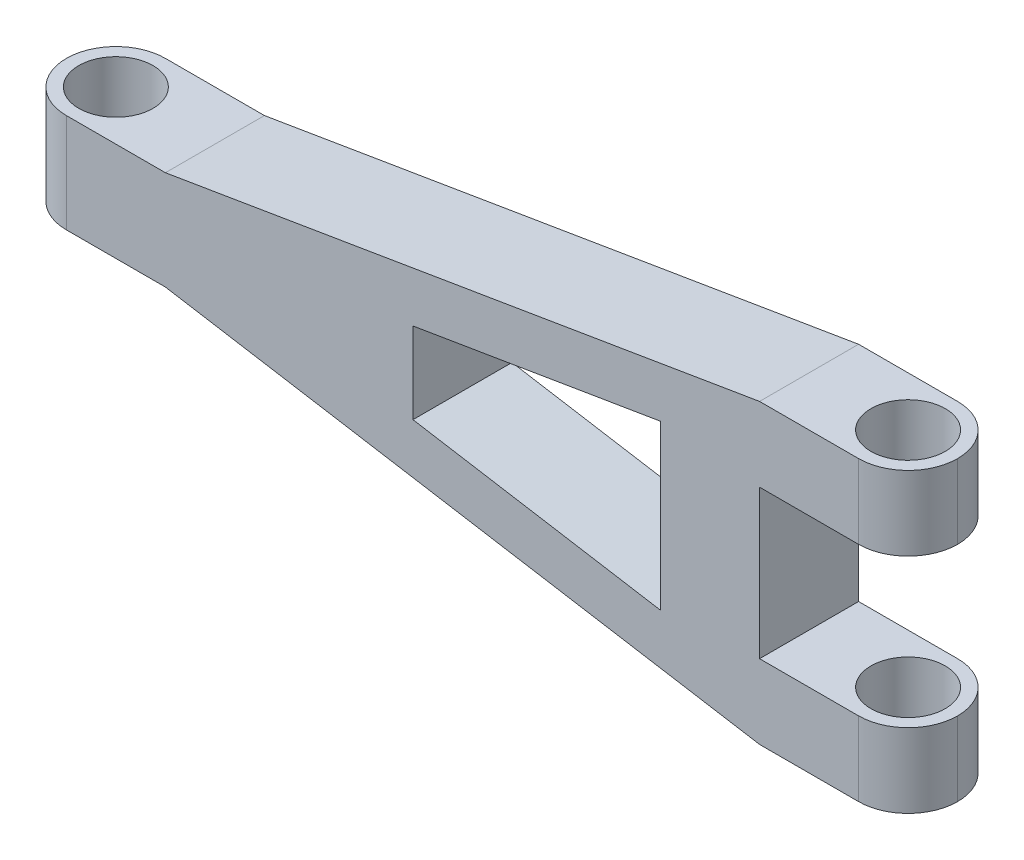
ISO-10303-21;
HEADER;
FILE_DESCRIPTION(('STEP AP214'),'2;1');
FILE_NAME('part.step','',(''),(''),'','','');
FILE_SCHEMA(('AUTOMOTIVE_DESIGN { 1 0 10303 214 1 1 1 1 }'));
ENDSEC;
DATA;
#1=APPLICATION_CONTEXT('core data for automotive mechanical design processes');
#2=APPLICATION_PROTOCOL_DEFINITION('international standard','automotive_design',2000,#1);
#3=PRODUCT_CONTEXT('',#1,'mechanical');
#4=PRODUCT('Part','Part','',(#3));
#5=PRODUCT_RELATED_PRODUCT_CATEGORY('part','',(#4));
#6=PRODUCT_DEFINITION_FORMATION('','',#4);
#7=PRODUCT_DEFINITION_CONTEXT('part definition',#1,'design');
#8=PRODUCT_DEFINITION('design','',#6,#7);
#9=PRODUCT_DEFINITION_SHAPE('','',#8);
#10=(LENGTH_UNIT() NAMED_UNIT(*) SI_UNIT(.MILLI.,.METRE.));
#11=(NAMED_UNIT(*) PLANE_ANGLE_UNIT() SI_UNIT($,.RADIAN.));
#12=(NAMED_UNIT(*) SI_UNIT($,.STERADIAN.) SOLID_ANGLE_UNIT());
#13=UNCERTAINTY_MEASURE_WITH_UNIT(LENGTH_MEASURE(1.E-05),#10,'distance_accuracy_value','');
#14=(GEOMETRIC_REPRESENTATION_CONTEXT(3) GLOBAL_UNCERTAINTY_ASSIGNED_CONTEXT((#13)) GLOBAL_UNIT_ASSIGNED_CONTEXT((#10,
#11,#12)) REPRESENTATION_CONTEXT('',''));
#15=CARTESIAN_POINT('',(0.,0.,0.));
#16=DIRECTION('',(0.,0.,1.));
#17=DIRECTION('',(1.,0.,0.));
#18=AXIS2_PLACEMENT_3D('',#15,#16,#17);
#19=CARTESIAN_POINT('',(-50.,-5.00000000000001,20.));
#20=DIRECTION('',(0.,-1.,0.));
#21=DIRECTION('',(1.,0.,0.));
#22=AXIS2_PLACEMENT_3D('',#19,#20,#21);
#23=PLANE('',#22);
#24=CARTESIAN_POINT('',(-70.,-5.,10.));
#25=DIRECTION('',(0.,-1.,0.));
#26=DIRECTION('',(1.,0.,0.));
#27=AXIS2_PLACEMENT_3D('',#24,#25,#26);
#28=CIRCLE('',#27,7.5);
#29=CARTESIAN_POINT('',(-70.,-5.,17.5));
#30=VERTEX_POINT('',#29);
#31=EDGE_CURVE('E339',#30,#30,#28,.T.);
#32=ORIENTED_EDGE('',*,*,#31,.F.);
#33=EDGE_LOOP('',(#32));
#34=FACE_BOUND('',#33,.T.);
#35=CARTESIAN_POINT('',(-70.,-5.,10.));
#36=DIRECTION('',(0.,-1.,0.));
#37=DIRECTION('',(1.,0.,0.));
#38=AXIS2_PLACEMENT_3D('',#35,#36,#37);
#39=CIRCLE('',#38,10.);
#40=CARTESIAN_POINT('',(-70.,-5.,20.));
#41=VERTEX_POINT('',#40);
#42=CARTESIAN_POINT('',(-80.,-5.,10.));
#43=VERTEX_POINT('',#42);
#44=EDGE_CURVE('E65',#41,#43,#39,.T.);
#45=ORIENTED_EDGE('',*,*,#44,.T.);
#46=CARTESIAN_POINT('',(-70.,-5.,10.));
#47=DIRECTION('',(0.,-1.,0.));
#48=DIRECTION('',(1.,0.,0.));
#49=AXIS2_PLACEMENT_3D('',#46,#47,#48);
#50=CIRCLE('',#49,10.);
#51=CARTESIAN_POINT('',(-70.,-5.,0.));
#52=VERTEX_POINT('',#51);
#53=EDGE_CURVE('E314',#43,#52,#50,.T.);
#54=ORIENTED_EDGE('',*,*,#53,.T.);
#55=DIRECTION('',(-1.,0.,0.));
#56=VECTOR('',#55,1.);
#57=CARTESIAN_POINT('',(-50.,-5.00000000000001,0.));
#58=LINE('',#57,#56);
#59=CARTESIAN_POINT('',(-50.,-5.00000000000001,0.));
#60=VERTEX_POINT('',#59);
#61=EDGE_CURVE('E217',#60,#52,#58,.T.);
#62=ORIENTED_EDGE('',*,*,#61,.F.);
#63=DIRECTION('',(0.,0.,-1.));
#64=VECTOR('',#63,1.);
#65=CARTESIAN_POINT('',(-50.,-5.00000000000001,20.));
#66=LINE('',#65,#64);
#67=CARTESIAN_POINT('',(-50.,-5.00000000000001,20.));
#68=VERTEX_POINT('',#67);
#69=EDGE_CURVE('E280',#68,#60,#66,.T.);
#70=ORIENTED_EDGE('',*,*,#69,.F.);
#71=DIRECTION('',(-1.,0.,0.));
#72=VECTOR('',#71,1.);
#73=CARTESIAN_POINT('',(-50.,-5.00000000000001,20.));
#74=LINE('',#73,#72);
#75=EDGE_CURVE('E221',#68,#41,#74,.T.);
#76=ORIENTED_EDGE('',*,*,#75,.T.);
#77=EDGE_LOOP('',(#45,#54,#62,#70,#76));
#78=FACE_BOUND('',#77,.T.);
#79=ADVANCED_FACE('F42',(#34,#78),#23,.T.);
#80=CARTESIAN_POINT('',(70.,-25.,20.));
#81=DIRECTION('',(-0.164398987305357,-0.986393923832144,0.));
#82=DIRECTION('',(0.986393923832144,-0.164398987305357,0.));
#83=AXIS2_PLACEMENT_3D('',#80,#81,#82);
#84=PLANE('',#83);
#85=DIRECTION('',(-0.986393923832144,0.164398987305357,0.));
#86=VECTOR('',#85,1.);
#87=CARTESIAN_POINT('',(70.,-25.,0.));
#88=LINE('',#87,#86);
#89=CARTESIAN_POINT('',(70.,-25.,0.));
#90=VERTEX_POINT('',#89);
#91=EDGE_CURVE('E248',#90,#60,#88,.T.);
#92=ORIENTED_EDGE('',*,*,#91,.F.);
#93=DIRECTION('',(0.,0.,-1.));
#94=VECTOR('',#93,1.);
#95=CARTESIAN_POINT('',(70.,-25.,20.));
#96=LINE('',#95,#94);
#97=CARTESIAN_POINT('',(70.,-25.,20.));
#98=VERTEX_POINT('',#97);
#99=EDGE_CURVE('E278',#98,#90,#96,.T.);
#100=ORIENTED_EDGE('',*,*,#99,.F.);
#101=DIRECTION('',(-0.986393923832144,0.164398987305357,0.));
#102=VECTOR('',#101,1.);
#103=CARTESIAN_POINT('',(70.,-25.,20.));
#104=LINE('',#103,#102);
#105=EDGE_CURVE('E223',#98,#68,#104,.T.);
#106=ORIENTED_EDGE('',*,*,#105,.T.);
#107=ORIENTED_EDGE('',*,*,#69,.T.);
#108=EDGE_LOOP('',(#92,#100,#106,#107));
#109=FACE_BOUND('',#108,.T.);
#110=ADVANCED_FACE('F365',(#109),#84,.T.);
#111=CARTESIAN_POINT('',(70.,-25.,20.));
#112=DIRECTION('',(0.,1.,0.));
#113=DIRECTION('',(0.,0.,1.));
#114=AXIS2_PLACEMENT_3D('',#111,#112,#113);
#115=PLANE('',#114);
#116=CARTESIAN_POINT('',(90.0000000000001,-25.,10.));
#117=DIRECTION('',(0.,1.,0.));
#118=DIRECTION('',(0.,0.,1.));
#119=AXIS2_PLACEMENT_3D('',#116,#117,#118);
#120=CIRCLE('',#119,7.5);
#121=CARTESIAN_POINT('',(90.0000000000001,-25.,17.5));
#122=VERTEX_POINT('',#121);
#123=EDGE_CURVE('E330',#122,#122,#120,.T.);
#124=ORIENTED_EDGE('',*,*,#123,.T.);
#125=EDGE_LOOP('',(#124));
#126=FACE_BOUND('',#125,.T.);
#127=CARTESIAN_POINT('',(90.,-25.,10.));
#128=DIRECTION('',(0.,1.,0.));
#129=DIRECTION('',(0.,0.,1.));
#130=AXIS2_PLACEMENT_3D('',#127,#128,#129);
#131=CIRCLE('',#130,10.);
#132=CARTESIAN_POINT('',(90.,-25.,0.));
#133=VERTEX_POINT('',#132);
#134=CARTESIAN_POINT('',(100.,-25.,10.));
#135=VERTEX_POINT('',#134);
#136=EDGE_CURVE('E282',#133,#135,#131,.F.);
#137=ORIENTED_EDGE('',*,*,#136,.T.);
#138=CARTESIAN_POINT('',(90.,-25.,10.));
#139=DIRECTION('',(0.,1.,0.));
#140=DIRECTION('',(0.,0.,1.));
#141=AXIS2_PLACEMENT_3D('',#138,#139,#140);
#142=CIRCLE('',#141,10.);
#143=CARTESIAN_POINT('',(90.,-25.,20.));
#144=VERTEX_POINT('',#143);
#145=EDGE_CURVE('E284',#135,#144,#142,.F.);
#146=ORIENTED_EDGE('',*,*,#145,.T.);
#147=DIRECTION('',(1.,0.,0.));
#148=VECTOR('',#147,1.);
#149=CARTESIAN_POINT('',(70.,-25.,20.));
#150=LINE('',#149,#148);
#151=EDGE_CURVE('E227',#98,#144,#150,.T.);
#152=ORIENTED_EDGE('',*,*,#151,.F.);
#153=ORIENTED_EDGE('',*,*,#99,.T.);
#154=DIRECTION('',(1.,0.,0.));
#155=VECTOR('',#154,1.);
#156=CARTESIAN_POINT('',(70.,-25.,0.));
#157=LINE('',#156,#155);
#158=EDGE_CURVE('E251',#90,#133,#157,.T.);
#159=ORIENTED_EDGE('',*,*,#158,.T.);
#160=EDGE_LOOP('',(#137,#146,#152,#153,#159));
#161=FACE_BOUND('',#160,.T.);
#162=ADVANCED_FACE('F406',(#126,#161),#115,.F.);
#163=CARTESIAN_POINT('',(100.,-10.,20.));
#164=DIRECTION('',(0.,-1.,0.));
#165=DIRECTION('',(0.,0.,-1.));
#166=AXIS2_PLACEMENT_3D('',#163,#164,#165);
#167=PLANE('',#166);
#168=CARTESIAN_POINT('',(90.0000000000001,-10.,10.));
#169=DIRECTION('',(0.,-1.,0.));
#170=DIRECTION('',(0.,0.,-1.));
#171=AXIS2_PLACEMENT_3D('',#168,#169,#170);
#172=CIRCLE('',#171,7.5);
#173=CARTESIAN_POINT('',(90.0000000000001,-10.,17.5));
#174=VERTEX_POINT('',#173);
#175=EDGE_CURVE('E204',#174,#174,#172,.T.);
#176=ORIENTED_EDGE('',*,*,#175,.T.);
#177=EDGE_LOOP('',(#176));
#178=FACE_BOUND('',#177,.T.);
#179=DIRECTION('',(-1.,0.,0.));
#180=VECTOR('',#179,1.);
#181=CARTESIAN_POINT('',(100.,-10.,20.));
#182=LINE('',#181,#180);
#183=CARTESIAN_POINT('',(90.,-10.,20.));
#184=VERTEX_POINT('',#183);
#185=CARTESIAN_POINT('',(70.,-10.,20.));
#186=VERTEX_POINT('',#185);
#187=EDGE_CURVE('E230',#184,#186,#182,.T.);
#188=ORIENTED_EDGE('',*,*,#187,.F.);
#189=CARTESIAN_POINT('',(90.,-10.,10.));
#190=DIRECTION('',(0.,-1.,0.));
#191=DIRECTION('',(0.,0.,-1.));
#192=AXIS2_PLACEMENT_3D('',#189,#190,#191);
#193=CIRCLE('',#192,10.);
#194=CARTESIAN_POINT('',(100.,-10.,10.));
#195=VERTEX_POINT('',#194);
#196=EDGE_CURVE('E295',#184,#195,#193,.F.);
#197=ORIENTED_EDGE('',*,*,#196,.T.);
#198=CARTESIAN_POINT('',(90.,-10.,10.));
#199=DIRECTION('',(0.,-1.,0.));
#200=DIRECTION('',(0.,0.,-1.));
#201=AXIS2_PLACEMENT_3D('',#198,#199,#200);
#202=CIRCLE('',#201,10.);
#203=CARTESIAN_POINT('',(90.,-10.,0.));
#204=VERTEX_POINT('',#203);
#205=EDGE_CURVE('E293',#195,#204,#202,.F.);
#206=ORIENTED_EDGE('',*,*,#205,.T.);
#207=DIRECTION('',(-1.,0.,0.));
#208=VECTOR('',#207,1.);
#209=CARTESIAN_POINT('',(100.,-10.,0.));
#210=LINE('',#209,#208);
#211=CARTESIAN_POINT('',(70.,-10.,0.));
#212=VERTEX_POINT('',#211);
#213=EDGE_CURVE('E254',#204,#212,#210,.T.);
#214=ORIENTED_EDGE('',*,*,#213,.T.);
#215=DIRECTION('',(0.,0.,-1.));
#216=VECTOR('',#215,1.);
#217=CARTESIAN_POINT('',(70.,-10.,20.));
#218=LINE('',#217,#216);
#219=EDGE_CURVE('E275',#186,#212,#218,.T.);
#220=ORIENTED_EDGE('',*,*,#219,.F.);
#221=EDGE_LOOP('',(#188,#197,#206,#214,#220));
#222=FACE_BOUND('',#221,.T.);
#223=ADVANCED_FACE('F410',(#178,#222),#167,.F.);
#224=CARTESIAN_POINT('',(70.,20.,20.));
#225=DIRECTION('',(1.,0.,0.));
#226=DIRECTION('',(0.,0.,-1.));
#227=AXIS2_PLACEMENT_3D('',#224,#225,#226);
#228=PLANE('',#227);
#229=DIRECTION('',(0.,-1.,0.));
#230=VECTOR('',#229,1.);
#231=CARTESIAN_POINT('',(70.,20.,0.));
#232=LINE('',#231,#230);
#233=CARTESIAN_POINT('',(70.,20.,0.));
#234=VERTEX_POINT('',#233);
#235=EDGE_CURVE('E256',#234,#212,#232,.T.);
#236=ORIENTED_EDGE('',*,*,#235,.F.);
#237=DIRECTION('',(0.,0.,-1.));
#238=VECTOR('',#237,1.);
#239=CARTESIAN_POINT('',(70.,20.,20.));
#240=LINE('',#239,#238);
#241=CARTESIAN_POINT('',(70.,20.,20.));
#242=VERTEX_POINT('',#241);
#243=EDGE_CURVE('E272',#242,#234,#240,.T.);
#244=ORIENTED_EDGE('',*,*,#243,.F.);
#245=DIRECTION('',(0.,-1.,0.));
#246=VECTOR('',#245,1.);
#247=CARTESIAN_POINT('',(70.,20.,20.));
#248=LINE('',#247,#246);
#249=EDGE_CURVE('E232',#242,#186,#248,.T.);
#250=ORIENTED_EDGE('',*,*,#249,.T.);
#251=ORIENTED_EDGE('',*,*,#219,.T.);
#252=EDGE_LOOP('',(#236,#244,#250,#251));
#253=FACE_BOUND('',#252,.T.);
#254=ADVANCED_FACE('F395',(#253),#228,.T.);
#255=CARTESIAN_POINT('',(100.,20.,20.));
#256=DIRECTION('',(0.,-1.,0.));
#257=DIRECTION('',(1.,0.,0.));
#258=AXIS2_PLACEMENT_3D('',#255,#256,#257);
#259=PLANE('',#258);
#260=CARTESIAN_POINT('',(90.0000000000001,20.,10.));
#261=DIRECTION('',(0.,-1.,0.));
#262=DIRECTION('',(1.,0.,0.));
#263=AXIS2_PLACEMENT_3D('',#260,#261,#262);
#264=CIRCLE('',#263,7.5);
#265=CARTESIAN_POINT('',(90.0000000000001,20.,17.5));
#266=VERTEX_POINT('',#265);
#267=EDGE_CURVE('E326',#266,#266,#264,.T.);
#268=ORIENTED_EDGE('',*,*,#267,.F.);
#269=EDGE_LOOP('',(#268));
#270=FACE_BOUND('',#269,.T.);
#271=DIRECTION('',(-1.,0.,0.));
#272=VECTOR('',#271,1.);
#273=CARTESIAN_POINT('',(100.,20.,0.));
#274=LINE('',#273,#272);
#275=CARTESIAN_POINT('',(90.0000000000001,20.,0.));
#276=VERTEX_POINT('',#275);
#277=EDGE_CURVE('E259',#276,#234,#274,.T.);
#278=ORIENTED_EDGE('',*,*,#277,.F.);
#279=CARTESIAN_POINT('',(90.0000000000001,20.,10.));
#280=DIRECTION('',(0.,-1.,0.));
#281=DIRECTION('',(1.,0.,0.));
#282=AXIS2_PLACEMENT_3D('',#279,#280,#281);
#283=CIRCLE('',#282,10.);
#284=CARTESIAN_POINT('',(100.,20.,10.));
#285=VERTEX_POINT('',#284);
#286=EDGE_CURVE('E311',#276,#285,#283,.T.);
#287=ORIENTED_EDGE('',*,*,#286,.T.);
#288=CARTESIAN_POINT('',(90.0000000000001,20.,10.));
#289=DIRECTION('',(0.,-1.,0.));
#290=DIRECTION('',(1.,0.,0.));
#291=AXIS2_PLACEMENT_3D('',#288,#289,#290);
#292=CIRCLE('',#291,10.);
#293=CARTESIAN_POINT('',(90.0000000000001,20.,20.));
#294=VERTEX_POINT('',#293);
#295=EDGE_CURVE('E309',#285,#294,#292,.T.);
#296=ORIENTED_EDGE('',*,*,#295,.T.);
#297=DIRECTION('',(-1.,0.,0.));
#298=VECTOR('',#297,1.);
#299=CARTESIAN_POINT('',(100.,20.,20.));
#300=LINE('',#299,#298);
#301=EDGE_CURVE('E235',#294,#242,#300,.T.);
#302=ORIENTED_EDGE('',*,*,#301,.T.);
#303=ORIENTED_EDGE('',*,*,#243,.T.);
#304=EDGE_LOOP('',(#278,#287,#296,#302,#303));
#305=FACE_BOUND('',#304,.T.);
#306=ADVANCED_FACE('F386',(#270,#305),#259,.T.);
#307=CARTESIAN_POINT('',(70.,35.,20.));
#308=DIRECTION('',(0.,1.,0.));
#309=DIRECTION('',(-1.,0.,0.));
#310=AXIS2_PLACEMENT_3D('',#307,#308,#309);
#311=PLANE('',#310);
#312=CARTESIAN_POINT('',(90.0000000000001,35.,10.));
#313=DIRECTION('',(0.,1.,0.));
#314=DIRECTION('',(0.,0.,1.));
#315=AXIS2_PLACEMENT_3D('',#312,#313,#314);
#316=CIRCLE('',#315,7.5);
#317=CARTESIAN_POINT('',(90.0000000000001,35.,17.5));
#318=VERTEX_POINT('',#317);
#319=EDGE_CURVE('E334',#318,#318,#316,.T.);
#320=ORIENTED_EDGE('',*,*,#319,.F.);
#321=EDGE_LOOP('',(#320));
#322=FACE_BOUND('',#321,.T.);
#323=CARTESIAN_POINT('',(90.0000000000001,35.,10.));
#324=DIRECTION('',(0.,1.,0.));
#325=DIRECTION('',(-1.,0.,0.));
#326=AXIS2_PLACEMENT_3D('',#323,#324,#325);
#327=CIRCLE('',#326,10.);
#328=CARTESIAN_POINT('',(90.0000000000001,35.,20.));
#329=VERTEX_POINT('',#328);
#330=CARTESIAN_POINT('',(100.,35.,10.));
#331=VERTEX_POINT('',#330);
#332=EDGE_CURVE('E305',#329,#331,#327,.T.);
#333=ORIENTED_EDGE('',*,*,#332,.T.);
#334=CARTESIAN_POINT('',(90.0000000000001,35.,10.));
#335=DIRECTION('',(0.,1.,0.));
#336=DIRECTION('',(-1.,0.,0.));
#337=AXIS2_PLACEMENT_3D('',#334,#335,#336);
#338=CIRCLE('',#337,10.);
#339=CARTESIAN_POINT('',(90.0000000000001,35.,0.));
#340=VERTEX_POINT('',#339);
#341=EDGE_CURVE('E307',#331,#340,#338,.T.);
#342=ORIENTED_EDGE('',*,*,#341,.T.);
#343=DIRECTION('',(1.,0.,0.));
#344=VECTOR('',#343,1.);
#345=CARTESIAN_POINT('',(70.,35.,0.));
#346=LINE('',#345,#344);
#347=CARTESIAN_POINT('',(70.,35.,0.));
#348=VERTEX_POINT('',#347);
#349=EDGE_CURVE('E261',#348,#340,#346,.T.);
#350=ORIENTED_EDGE('',*,*,#349,.F.);
#351=DIRECTION('',(0.,0.,-1.));
#352=VECTOR('',#351,1.);
#353=CARTESIAN_POINT('',(70.,35.,20.));
#354=LINE('',#353,#352);
#355=CARTESIAN_POINT('',(70.,35.,20.));
#356=VERTEX_POINT('',#355);
#357=EDGE_CURVE('E270',#356,#348,#354,.T.);
#358=ORIENTED_EDGE('',*,*,#357,.F.);
#359=DIRECTION('',(1.,0.,0.));
#360=VECTOR('',#359,1.);
#361=CARTESIAN_POINT('',(70.,35.,20.));
#362=LINE('',#361,#360);
#363=EDGE_CURVE('E237',#356,#329,#362,.T.);
#364=ORIENTED_EDGE('',*,*,#363,.T.);
#365=EDGE_LOOP('',(#333,#342,#350,#358,#364));
#366=FACE_BOUND('',#365,.T.);
#367=ADVANCED_FACE('F376',(#322,#366),#311,.T.);
#368=CARTESIAN_POINT('',(70.,35.,20.));
#369=DIRECTION('',(0.164398987305357,-0.986393923832144,0.));
#370=DIRECTION('',(0.986393923832144,0.164398987305357,0.));
#371=AXIS2_PLACEMENT_3D('',#368,#369,#370);
#372=PLANE('',#371);
#373=DIRECTION('',(-0.986393923832144,-0.164398987305357,0.));
#374=VECTOR('',#373,1.);
#375=CARTESIAN_POINT('',(70.,35.,0.));
#376=LINE('',#375,#374);
#377=CARTESIAN_POINT('',(-50.,15.,0.));
#378=VERTEX_POINT('',#377);
#379=EDGE_CURVE('E264',#348,#378,#376,.T.);
#380=ORIENTED_EDGE('',*,*,#379,.T.);
#381=DIRECTION('',(0.,0.,-1.));
#382=VECTOR('',#381,1.);
#383=CARTESIAN_POINT('',(-50.,15.,20.));
#384=LINE('',#383,#382);
#385=CARTESIAN_POINT('',(-50.,15.,20.));
#386=VERTEX_POINT('',#385);
#387=EDGE_CURVE('E245',#386,#378,#384,.T.);
#388=ORIENTED_EDGE('',*,*,#387,.F.);
#389=DIRECTION('',(-0.986393923832144,-0.164398987305357,0.));
#390=VECTOR('',#389,1.);
#391=CARTESIAN_POINT('',(70.,35.,20.));
#392=LINE('',#391,#390);
#393=EDGE_CURVE('E240',#356,#386,#392,.T.);
#394=ORIENTED_EDGE('',*,*,#393,.F.);
#395=ORIENTED_EDGE('',*,*,#357,.T.);
#396=EDGE_LOOP('',(#380,#388,#394,#395));
#397=FACE_BOUND('',#396,.T.);
#398=ADVANCED_FACE('F350',(#397),#372,.F.);
#399=CARTESIAN_POINT('',(-80.,15.,20.));
#400=DIRECTION('',(0.,1.,0.));
#401=DIRECTION('',(-1.,0.,0.));
#402=AXIS2_PLACEMENT_3D('',#399,#400,#401);
#403=PLANE('',#402);
#404=CARTESIAN_POINT('',(-70.,15.,10.));
#405=DIRECTION('',(0.,1.,0.));
#406=DIRECTION('',(-1.,0.,0.));
#407=AXIS2_PLACEMENT_3D('',#404,#405,#406);
#408=CIRCLE('',#407,7.5);
#409=CARTESIAN_POINT('',(-70.,15.,17.5));
#410=VERTEX_POINT('',#409);
#411=EDGE_CURVE('E46',#410,#410,#408,.T.);
#412=ORIENTED_EDGE('',*,*,#411,.F.);
#413=EDGE_LOOP('',(#412));
#414=FACE_BOUND('',#413,.T.);
#415=DIRECTION('',(1.,0.,0.));
#416=VECTOR('',#415,1.);
#417=CARTESIAN_POINT('',(-80.,15.,0.));
#418=LINE('',#417,#416);
#419=CARTESIAN_POINT('',(-70.,15.,0.));
#420=VERTEX_POINT('',#419);
#421=EDGE_CURVE('E224',#420,#378,#418,.T.);
#422=ORIENTED_EDGE('',*,*,#421,.F.);
#423=CARTESIAN_POINT('',(-70.,15.,10.));
#424=DIRECTION('',(0.,1.,0.));
#425=DIRECTION('',(-1.,0.,0.));
#426=AXIS2_PLACEMENT_3D('',#423,#424,#425);
#427=CIRCLE('',#426,10.);
#428=CARTESIAN_POINT('',(-80.,15.,10.));
#429=VERTEX_POINT('',#428);
#430=EDGE_CURVE('E11',#420,#429,#427,.T.);
#431=ORIENTED_EDGE('',*,*,#430,.T.);
#432=CARTESIAN_POINT('',(-70.,15.,10.));
#433=DIRECTION('',(0.,1.,0.));
#434=DIRECTION('',(-1.,0.,0.));
#435=AXIS2_PLACEMENT_3D('',#432,#433,#434);
#436=CIRCLE('',#435,10.);
#437=CARTESIAN_POINT('',(-70.,15.,20.));
#438=VERTEX_POINT('',#437);
#439=EDGE_CURVE('E51',#429,#438,#436,.T.);
#440=ORIENTED_EDGE('',*,*,#439,.T.);
#441=DIRECTION('',(1.,0.,0.));
#442=VECTOR('',#441,1.);
#443=CARTESIAN_POINT('',(-80.,15.,20.));
#444=LINE('',#443,#442);
#445=EDGE_CURVE('E243',#438,#386,#444,.T.);
#446=ORIENTED_EDGE('',*,*,#445,.T.);
#447=ORIENTED_EDGE('',*,*,#387,.T.);
#448=EDGE_LOOP('',(#422,#431,#440,#446,#447));
#449=FACE_BOUND('',#448,.T.);
#450=ADVANCED_FACE('F348',(#414,#449),#403,.T.);
#451=CARTESIAN_POINT('',(-80.,-25.,20.));
#452=DIRECTION('',(0.,0.,1.));
#453=DIRECTION('',(1.,0.,0.));
#454=AXIS2_PLACEMENT_3D('',#451,#452,#453);
#455=PLANE('',#454);
#456=DIRECTION('',(0.,-1.,0.));
#457=VECTOR('',#456,1.);
#458=CARTESIAN_POINT('',(50.,21.5287291161696,20.));
#459=LINE('',#458,#457);
#460=CARTESIAN_POINT('',(50.,21.5287291161696,20.));
#461=VERTEX_POINT('',#460);
#462=CARTESIAN_POINT('',(50.,-11.5287291161696,20.));
#463=VERTEX_POINT('',#462);
#464=EDGE_CURVE('E186',#461,#463,#459,.T.);
#465=ORIENTED_EDGE('',*,*,#464,.T.);
#466=DIRECTION('',(0.986393923832144,-0.164398987305357,0.));
#467=VECTOR('',#466,1.);
#468=CARTESIAN_POINT('',(0.,-3.1953957828363,20.));
#469=LINE('',#468,#467);
#470=CARTESIAN_POINT('',(0.,-3.1953957828363,20.));
#471=VERTEX_POINT('',#470);
#472=EDGE_CURVE('E174',#471,#463,#469,.T.);
#473=ORIENTED_EDGE('',*,*,#472,.F.);
#474=DIRECTION('',(0.,-1.,0.));
#475=VECTOR('',#474,1.);
#476=CARTESIAN_POINT('',(0.,13.1953957828363,20.));
#477=LINE('',#476,#475);
#478=CARTESIAN_POINT('',(0.,13.1953957828363,20.));
#479=VERTEX_POINT('',#478);
#480=EDGE_CURVE('E185',#479,#471,#477,.T.);
#481=ORIENTED_EDGE('',*,*,#480,.F.);
#482=DIRECTION('',(-0.986393923832144,-0.164398987305357,0.));
#483=VECTOR('',#482,1.);
#484=CARTESIAN_POINT('',(50.,21.5287291161696,20.));
#485=LINE('',#484,#483);
#486=EDGE_CURVE('E194',#461,#479,#485,.T.);
#487=ORIENTED_EDGE('',*,*,#486,.F.);
#488=EDGE_LOOP('',(#465,#473,#481,#487));
#489=FACE_BOUND('',#488,.T.);
#490=ORIENTED_EDGE('',*,*,#151,.T.);
#491=DIRECTION('',(0.,-1.,0.));
#492=VECTOR('',#491,1.);
#493=CARTESIAN_POINT('',(90.,-25.,20.));
#494=LINE('',#493,#492);
#495=EDGE_CURVE('E290',#144,#184,#494,.F.);
#496=ORIENTED_EDGE('',*,*,#495,.T.);
#497=ORIENTED_EDGE('',*,*,#187,.T.);
#498=ORIENTED_EDGE('',*,*,#249,.F.);
#499=ORIENTED_EDGE('',*,*,#301,.F.);
#500=DIRECTION('',(0.,1.,0.));
#501=VECTOR('',#500,1.);
#502=CARTESIAN_POINT('',(90.0000000000001,35.,20.));
#503=LINE('',#502,#501);
#504=EDGE_CURVE('E288',#294,#329,#503,.T.);
#505=ORIENTED_EDGE('',*,*,#504,.T.);
#506=ORIENTED_EDGE('',*,*,#363,.F.);
#507=ORIENTED_EDGE('',*,*,#393,.T.);
#508=ORIENTED_EDGE('',*,*,#445,.F.);
#509=DIRECTION('',(0.,-1.,0.));
#510=VECTOR('',#509,1.);
#511=CARTESIAN_POINT('',(-70.,-5.,20.));
#512=LINE('',#511,#510);
#513=EDGE_CURVE('E286',#438,#41,#512,.T.);
#514=ORIENTED_EDGE('',*,*,#513,.T.);
#515=ORIENTED_EDGE('',*,*,#75,.F.);
#516=ORIENTED_EDGE('',*,*,#105,.F.);
#517=EDGE_LOOP('',(#490,#496,#497,#498,#499,#505,#506,#507,#508,#514,#515,#516));
#518=FACE_BOUND('',#517,.T.);
#519=ADVANCED_FACE('F196',(#489,#518),#455,.T.);
#520=CARTESIAN_POINT('',(-80.,-25.,0.));
#521=DIRECTION('',(0.,0.,1.));
#522=DIRECTION('',(1.,0.,0.));
#523=AXIS2_PLACEMENT_3D('',#520,#521,#522);
#524=PLANE('',#523);
#525=DIRECTION('',(0.986393923832144,-0.164398987305357,0.));
#526=VECTOR('',#525,1.);
#527=CARTESIAN_POINT('',(0.,-3.1953957828363,0.));
#528=LINE('',#527,#526);
#529=CARTESIAN_POINT('',(0.,-3.1953957828363,0.));
#530=VERTEX_POINT('',#529);
#531=CARTESIAN_POINT('',(50.,-11.5287291161696,0.));
#532=VERTEX_POINT('',#531);
#533=EDGE_CURVE('E210',#530,#532,#528,.T.);
#534=ORIENTED_EDGE('',*,*,#533,.T.);
#535=DIRECTION('',(0.,-1.,0.));
#536=VECTOR('',#535,1.);
#537=CARTESIAN_POINT('',(50.,21.5287291161696,0.));
#538=LINE('',#537,#536);
#539=CARTESIAN_POINT('',(50.,21.5287291161696,0.));
#540=VERTEX_POINT('',#539);
#541=EDGE_CURVE('E193',#540,#532,#538,.T.);
#542=ORIENTED_EDGE('',*,*,#541,.F.);
#543=DIRECTION('',(-0.986393923832144,-0.164398987305357,0.));
#544=VECTOR('',#543,1.);
#545=CARTESIAN_POINT('',(50.,21.5287291161696,0.));
#546=LINE('',#545,#544);
#547=CARTESIAN_POINT('',(0.,13.1953957828363,0.));
#548=VERTEX_POINT('',#547);
#549=EDGE_CURVE('E198',#540,#548,#546,.T.);
#550=ORIENTED_EDGE('',*,*,#549,.T.);
#551=DIRECTION('',(0.,-1.,0.));
#552=VECTOR('',#551,1.);
#553=CARTESIAN_POINT('',(0.,13.1953957828363,0.));
#554=LINE('',#553,#552);
#555=EDGE_CURVE('E201',#548,#530,#554,.T.);
#556=ORIENTED_EDGE('',*,*,#555,.T.);
#557=EDGE_LOOP('',(#534,#542,#550,#556));
#558=FACE_BOUND('',#557,.T.);
#559=ORIENTED_EDGE('',*,*,#213,.F.);
#560=DIRECTION('',(0.,-1.,0.));
#561=VECTOR('',#560,1.);
#562=CARTESIAN_POINT('',(90.,-25.,0.));
#563=LINE('',#562,#561);
#564=EDGE_CURVE('E303',#204,#133,#563,.T.);
#565=ORIENTED_EDGE('',*,*,#564,.T.);
#566=ORIENTED_EDGE('',*,*,#158,.F.);
#567=ORIENTED_EDGE('',*,*,#91,.T.);
#568=ORIENTED_EDGE('',*,*,#61,.T.);
#569=DIRECTION('',(0.,-1.,0.));
#570=VECTOR('',#569,1.);
#571=CARTESIAN_POINT('',(-70.,-25.,0.));
#572=LINE('',#571,#570);
#573=EDGE_CURVE('E297',#52,#420,#572,.F.);
#574=ORIENTED_EDGE('',*,*,#573,.T.);
#575=ORIENTED_EDGE('',*,*,#421,.T.);
#576=ORIENTED_EDGE('',*,*,#379,.F.);
#577=ORIENTED_EDGE('',*,*,#349,.T.);
#578=DIRECTION('',(0.,1.,0.));
#579=VECTOR('',#578,1.);
#580=CARTESIAN_POINT('',(90.0000000000001,-25.,0.));
#581=LINE('',#580,#579);
#582=EDGE_CURVE('E300',#340,#276,#581,.F.);
#583=ORIENTED_EDGE('',*,*,#582,.T.);
#584=ORIENTED_EDGE('',*,*,#277,.T.);
#585=ORIENTED_EDGE('',*,*,#235,.T.);
#586=EDGE_LOOP('',(#559,#565,#566,#567,#568,#574,#575,#576,#577,#583,#584,#585));
#587=FACE_BOUND('',#586,.T.);
#588=ADVANCED_FACE('F356',(#558,#587),#524,.F.);
#589=CARTESIAN_POINT('',(50.,21.5287291161696,20.));
#590=DIRECTION('',(1.,0.,0.));
#591=DIRECTION('',(0.,0.,-1.));
#592=AXIS2_PLACEMENT_3D('',#589,#590,#591);
#593=PLANE('',#592);
#594=ORIENTED_EDGE('',*,*,#541,.T.);
#595=DIRECTION('',(0.,0.,-1.));
#596=VECTOR('',#595,1.);
#597=CARTESIAN_POINT('',(50.,-11.5287291161696,20.));
#598=LINE('',#597,#596);
#599=EDGE_CURVE('E178',#463,#532,#598,.T.);
#600=ORIENTED_EDGE('',*,*,#599,.F.);
#601=ORIENTED_EDGE('',*,*,#464,.F.);
#602=DIRECTION('',(0.,0.,-1.));
#603=VECTOR('',#602,1.);
#604=CARTESIAN_POINT('',(50.,21.5287291161696,20.));
#605=LINE('',#604,#603);
#606=EDGE_CURVE('E215',#461,#540,#605,.T.);
#607=ORIENTED_EDGE('',*,*,#606,.T.);
#608=EDGE_LOOP('',(#594,#600,#601,#607));
#609=FACE_BOUND('',#608,.T.);
#610=ADVANCED_FACE('F190',(#609),#593,.F.);
#611=CARTESIAN_POINT('',(50.,21.5287291161696,20.));
#612=DIRECTION('',(0.164398987305357,-0.986393923832144,0.));
#613=DIRECTION('',(0.986393923832144,0.164398987305357,0.));
#614=AXIS2_PLACEMENT_3D('',#611,#612,#613);
#615=PLANE('',#614);
#616=ORIENTED_EDGE('',*,*,#549,.F.);
#617=ORIENTED_EDGE('',*,*,#606,.F.);
#618=ORIENTED_EDGE('',*,*,#486,.T.);
#619=DIRECTION('',(0.,0.,-1.));
#620=VECTOR('',#619,1.);
#621=CARTESIAN_POINT('',(0.,13.1953957828363,20.));
#622=LINE('',#621,#620);
#623=EDGE_CURVE('E218',#479,#548,#622,.T.);
#624=ORIENTED_EDGE('',*,*,#623,.T.);
#625=EDGE_LOOP('',(#616,#617,#618,#624));
#626=FACE_BOUND('',#625,.T.);
#627=ADVANCED_FACE('F474',(#626),#615,.T.);
#628=CARTESIAN_POINT('',(0.,13.1953957828363,20.));
#629=DIRECTION('',(1.,0.,0.));
#630=DIRECTION('',(0.,1.,0.));
#631=AXIS2_PLACEMENT_3D('',#628,#629,#630);
#632=PLANE('',#631);
#633=ORIENTED_EDGE('',*,*,#555,.F.);
#634=ORIENTED_EDGE('',*,*,#623,.F.);
#635=ORIENTED_EDGE('',*,*,#480,.T.);
#636=DIRECTION('',(0.,0.,-1.));
#637=VECTOR('',#636,1.);
#638=CARTESIAN_POINT('',(0.,-3.1953957828363,20.));
#639=LINE('',#638,#637);
#640=EDGE_CURVE('E180',#471,#530,#639,.T.);
#641=ORIENTED_EDGE('',*,*,#640,.T.);
#642=EDGE_LOOP('',(#633,#634,#635,#641));
#643=FACE_BOUND('',#642,.T.);
#644=ADVANCED_FACE('F467',(#643),#632,.T.);
#645=CARTESIAN_POINT('',(0.,-3.1953957828363,20.));
#646=DIRECTION('',(0.164398987305357,0.986393923832144,0.));
#647=DIRECTION('',(-0.986393923832144,0.164398987305357,0.));
#648=AXIS2_PLACEMENT_3D('',#645,#646,#647);
#649=PLANE('',#648);
#650=ORIENTED_EDGE('',*,*,#533,.F.);
#651=ORIENTED_EDGE('',*,*,#640,.F.);
#652=ORIENTED_EDGE('',*,*,#472,.T.);
#653=ORIENTED_EDGE('',*,*,#599,.T.);
#654=EDGE_LOOP('',(#650,#651,#652,#653));
#655=FACE_BOUND('',#654,.T.);
#656=ADVANCED_FACE('F177',(#655),#649,.T.);
#657=CARTESIAN_POINT('',(90.,-25.,10.));
#658=DIRECTION('',(0.,1.,0.));
#659=DIRECTION('',(0.,0.,1.));
#660=AXIS2_PLACEMENT_3D('',#657,#658,#659);
#661=CYLINDRICAL_SURFACE('',#660,10.);
#662=ORIENTED_EDGE('',*,*,#564,.F.);
#663=ORIENTED_EDGE('',*,*,#205,.F.);
#664=DIRECTION('',(0.,-1.,0.));
#665=VECTOR('',#664,1.);
#666=CARTESIAN_POINT('',(100.,-10.,10.));
#667=LINE('',#666,#665);
#668=EDGE_CURVE('E211',#135,#195,#667,.F.);
#669=ORIENTED_EDGE('',*,*,#668,.F.);
#670=ORIENTED_EDGE('',*,*,#136,.F.);
#671=EDGE_LOOP('',(#662,#663,#669,#670));
#672=FACE_BOUND('',#671,.T.);
#673=ADVANCED_FACE('F402',(#672),#661,.T.);
#674=CARTESIAN_POINT('',(90.,-10.,10.));
#675=DIRECTION('',(0.,-1.,0.));
#676=DIRECTION('',(0.,0.,-1.));
#677=AXIS2_PLACEMENT_3D('',#674,#675,#676);
#678=CYLINDRICAL_SURFACE('',#677,10.);
#679=ORIENTED_EDGE('',*,*,#196,.F.);
#680=ORIENTED_EDGE('',*,*,#495,.F.);
#681=ORIENTED_EDGE('',*,*,#145,.F.);
#682=ORIENTED_EDGE('',*,*,#668,.T.);
#683=EDGE_LOOP('',(#679,#680,#681,#682));
#684=FACE_BOUND('',#683,.T.);
#685=ADVANCED_FACE('F408',(#684),#678,.T.);
#686=CARTESIAN_POINT('',(90.0000000000001,-25.,10.));
#687=DIRECTION('',(0.,-1.,0.));
#688=DIRECTION('',(0.,0.,-1.));
#689=AXIS2_PLACEMENT_3D('',#686,#687,#688);
#690=CYLINDRICAL_SURFACE('',#689,10.);
#691=ORIENTED_EDGE('',*,*,#504,.F.);
#692=ORIENTED_EDGE('',*,*,#295,.F.);
#693=DIRECTION('',(0.,1.,0.));
#694=VECTOR('',#693,1.);
#695=CARTESIAN_POINT('',(100.,20.,10.));
#696=LINE('',#695,#694);
#697=EDGE_CURVE('E319',#331,#285,#696,.F.);
#698=ORIENTED_EDGE('',*,*,#697,.F.);
#699=ORIENTED_EDGE('',*,*,#332,.F.);
#700=EDGE_LOOP('',(#691,#692,#698,#699));
#701=FACE_BOUND('',#700,.T.);
#702=ADVANCED_FACE('F390',(#701),#690,.T.);
#703=CARTESIAN_POINT('',(90.0000000000001,20.,10.));
#704=DIRECTION('',(0.,1.,0.));
#705=DIRECTION('',(0.,0.,1.));
#706=AXIS2_PLACEMENT_3D('',#703,#704,#705);
#707=CYLINDRICAL_SURFACE('',#706,10.);
#708=ORIENTED_EDGE('',*,*,#286,.F.);
#709=ORIENTED_EDGE('',*,*,#582,.F.);
#710=ORIENTED_EDGE('',*,*,#341,.F.);
#711=ORIENTED_EDGE('',*,*,#697,.T.);
#712=EDGE_LOOP('',(#708,#709,#710,#711));
#713=FACE_BOUND('',#712,.T.);
#714=ADVANCED_FACE('F382',(#713),#707,.T.);
#715=CARTESIAN_POINT('',(-70.,-25.,10.));
#716=DIRECTION('',(0.,1.,0.));
#717=DIRECTION('',(0.,0.,1.));
#718=AXIS2_PLACEMENT_3D('',#715,#716,#717);
#719=CYLINDRICAL_SURFACE('',#718,10.);
#720=ORIENTED_EDGE('',*,*,#513,.F.);
#721=ORIENTED_EDGE('',*,*,#439,.F.);
#722=DIRECTION('',(0.,-1.,0.));
#723=VECTOR('',#722,1.);
#724=CARTESIAN_POINT('',(-80.,15.,10.));
#725=LINE('',#724,#723);
#726=EDGE_CURVE('E321',#43,#429,#725,.F.);
#727=ORIENTED_EDGE('',*,*,#726,.F.);
#728=ORIENTED_EDGE('',*,*,#44,.F.);
#729=EDGE_LOOP('',(#720,#721,#727,#728));
#730=FACE_BOUND('',#729,.T.);
#731=ADVANCED_FACE('F44',(#730),#719,.T.);
#732=CARTESIAN_POINT('',(-70.,15.,10.));
#733=DIRECTION('',(0.,-1.,0.));
#734=DIRECTION('',(0.,0.,-1.));
#735=AXIS2_PLACEMENT_3D('',#732,#733,#734);
#736=CYLINDRICAL_SURFACE('',#735,10.);
#737=ORIENTED_EDGE('',*,*,#430,.F.);
#738=ORIENTED_EDGE('',*,*,#573,.F.);
#739=ORIENTED_EDGE('',*,*,#53,.F.);
#740=ORIENTED_EDGE('',*,*,#726,.T.);
#741=EDGE_LOOP('',(#737,#738,#739,#740));
#742=FACE_BOUND('',#741,.T.);
#743=ADVANCED_FACE('F360',(#742),#736,.T.);
#744=CARTESIAN_POINT('',(90.0000000000001,-25.,10.));
#745=DIRECTION('',(0.,1.,0.));
#746=DIRECTION('',(0.,0.,1.));
#747=AXIS2_PLACEMENT_3D('',#744,#745,#746);
#748=CYLINDRICAL_SURFACE('',#747,7.5);
#749=CARTESIAN_POINT('',(90.0000000000001,20.,17.5));
#750=CARTESIAN_POINT('',(90.0000000000001,20.15625,17.5));
#751=CARTESIAN_POINT('',(90.0000000000001,20.3125,17.5));
#752=CARTESIAN_POINT('',(90.0000000000001,20.625,17.5));
#753=CARTESIAN_POINT('',(90.0000000000001,20.78125,17.5));
#754=CARTESIAN_POINT('',(90.0000000000001,21.09375,17.5));
#755=CARTESIAN_POINT('',(90.0000000000001,21.25,17.5));
#756=CARTESIAN_POINT('',(90.0000000000001,21.5625,17.5));
#757=CARTESIAN_POINT('',(90.0000000000001,21.71875,17.5));
#758=CARTESIAN_POINT('',(90.0000000000001,22.03125,17.5));
#759=CARTESIAN_POINT('',(90.0000000000001,22.1875,17.5));
#760=CARTESIAN_POINT('',(90.0000000000001,22.5,17.5));
#761=CARTESIAN_POINT('',(90.0000000000001,22.65625,17.5));
#762=CARTESIAN_POINT('',(90.0000000000001,22.96875,17.5));
#763=CARTESIAN_POINT('',(90.0000000000001,23.125,17.5));
#764=CARTESIAN_POINT('',(90.0000000000001,23.4375,17.5));
#765=CARTESIAN_POINT('',(90.0000000000001,23.59375,17.5));
#766=CARTESIAN_POINT('',(90.0000000000001,23.90625,17.5));
#767=CARTESIAN_POINT('',(90.0000000000001,24.0625,17.5));
#768=CARTESIAN_POINT('',(90.0000000000001,24.375,17.5));
#769=CARTESIAN_POINT('',(90.0000000000001,24.53125,17.5));
#770=CARTESIAN_POINT('',(90.0000000000001,24.84375,17.5));
#771=CARTESIAN_POINT('',(90.0000000000001,25.,17.5));
#772=CARTESIAN_POINT('',(90.0000000000001,25.3125,17.5));
#773=CARTESIAN_POINT('',(90.0000000000001,25.46875,17.5));
#774=CARTESIAN_POINT('',(90.0000000000001,25.78125,17.5));
#775=CARTESIAN_POINT('',(90.0000000000001,25.9375,17.5));
#776=CARTESIAN_POINT('',(90.0000000000001,26.25,17.5));
#777=CARTESIAN_POINT('',(90.0000000000001,26.40625,17.5));
#778=CARTESIAN_POINT('',(90.0000000000001,26.71875,17.5));
#779=CARTESIAN_POINT('',(90.0000000000001,26.875,17.5));
#780=CARTESIAN_POINT('',(90.0000000000001,27.1875,17.5));
#781=CARTESIAN_POINT('',(90.0000000000001,27.34375,17.5));
#782=CARTESIAN_POINT('',(90.0000000000001,27.65625,17.5));
#783=CARTESIAN_POINT('',(90.0000000000001,27.8125,17.5));
#784=CARTESIAN_POINT('',(90.0000000000001,28.125,17.5));
#785=CARTESIAN_POINT('',(90.0000000000001,28.28125,17.5));
#786=CARTESIAN_POINT('',(90.0000000000001,28.59375,17.5));
#787=CARTESIAN_POINT('',(90.0000000000001,28.75,17.5));
#788=CARTESIAN_POINT('',(90.0000000000001,29.0625,17.5));
#789=CARTESIAN_POINT('',(90.0000000000001,29.21875,17.5));
#790=CARTESIAN_POINT('',(90.0000000000001,29.53125,17.5));
#791=CARTESIAN_POINT('',(90.0000000000001,29.6875,17.5));
#792=CARTESIAN_POINT('',(90.0000000000001,30.,17.5));
#793=CARTESIAN_POINT('',(90.0000000000001,30.15625,17.5));
#794=CARTESIAN_POINT('',(90.0000000000001,30.46875,17.5));
#795=CARTESIAN_POINT('',(90.0000000000001,30.625,17.5));
#796=CARTESIAN_POINT('',(90.0000000000001,30.9375,17.5));
#797=CARTESIAN_POINT('',(90.0000000000001,31.09375,17.5));
#798=CARTESIAN_POINT('',(90.0000000000001,31.40625,17.5));
#799=CARTESIAN_POINT('',(90.0000000000001,31.5625,17.5));
#800=CARTESIAN_POINT('',(90.0000000000001,31.875,17.5));
#801=CARTESIAN_POINT('',(90.0000000000001,32.03125,17.5));
#802=CARTESIAN_POINT('',(90.0000000000001,32.34375,17.5));
#803=CARTESIAN_POINT('',(90.0000000000001,32.5,17.5));
#804=CARTESIAN_POINT('',(90.0000000000001,32.8125,17.5));
#805=CARTESIAN_POINT('',(90.0000000000001,32.96875,17.5));
#806=CARTESIAN_POINT('',(90.0000000000001,33.28125,17.5));
#807=CARTESIAN_POINT('',(90.0000000000001,33.4375,17.5));
#808=CARTESIAN_POINT('',(90.0000000000001,33.75,17.5));
#809=CARTESIAN_POINT('',(90.0000000000001,33.90625,17.5));
#810=CARTESIAN_POINT('',(90.0000000000001,34.21875,17.5));
#811=CARTESIAN_POINT('',(90.0000000000001,34.375,17.5));
#812=CARTESIAN_POINT('',(90.0000000000001,34.6875,17.5));
#813=CARTESIAN_POINT('',(90.0000000000001,34.84375,17.5));
#814=CARTESIAN_POINT('',(90.0000000000001,35.,17.5));
#815=B_SPLINE_CURVE_WITH_KNOTS('',3,(#749,#750,#751,#752,#753,#754,#755,#756,#757,#758,#759,
#760,#761,#762,#763,#764,#765,#766,#767,#768,#769,#770,#771,#772,#773,#774,#775,#776,#777,#778,
#779,#780,#781,#782,#783,#784,#785,#786,#787,#788,#789,#790,#791,#792,#793,#794,#795,#796,#797,
#798,#799,#800,#801,#802,#803,#804,#805,#806,#807,#808,#809,#810,#811,#812,#813,#814),
.UNSPECIFIED.,.F.,.F.,(4,2,2,2,2,2,2,2,2,2,2,2,2,2,2,2,2,2,2,2,2,2,2,2,2,2,2,2,2,2,2,2,4),(0.,
0.468749999999997,0.937500000000001,1.40625,1.875,2.34375,2.8125,3.28125,3.75,4.21874999999999,
4.6875,5.15624999999999,5.62499999999999,6.09374999999999,6.56249999999999,7.03125,
7.49999999999999,7.96875,8.43749999999999,8.90624999999999,9.37499999999999,9.84374999999999,
10.3125,10.78125,11.25,11.71875,12.1875,12.65625,13.125,13.59375,14.0625,14.53125,15.),.UNSPECIFIED.);
#816=EDGE_CURVE('BSEAM436',#266,#318,#815,.T.);
#817=ORIENTED_EDGE('',*,*,#267,.T.);
#818=ORIENTED_EDGE('',*,*,#319,.T.);
#819=ORIENTED_EDGE('',*,*,#816,.T.);
#820=ORIENTED_EDGE('',*,*,#816,.F.);
#821=EDGE_LOOP('',(#817,#819,#818,#820));
#822=FACE_BOUND('',#821,.T.);
#823=ADVANCED_FACE('F436',(#822),#748,.F.);
#824=CARTESIAN_POINT('',(90.0000000000001,-25.,17.5));
#825=CARTESIAN_POINT('',(90.0000000000001,-24.84375,17.5));
#826=CARTESIAN_POINT('',(90.0000000000001,-24.6875,17.5));
#827=CARTESIAN_POINT('',(90.0000000000001,-24.375,17.5));
#828=CARTESIAN_POINT('',(90.0000000000001,-24.21875,17.5));
#829=CARTESIAN_POINT('',(90.0000000000001,-23.90625,17.5));
#830=CARTESIAN_POINT('',(90.0000000000001,-23.75,17.5));
#831=CARTESIAN_POINT('',(90.0000000000001,-23.4375,17.5));
#832=CARTESIAN_POINT('',(90.0000000000001,-23.28125,17.5));
#833=CARTESIAN_POINT('',(90.0000000000001,-22.96875,17.5));
#834=CARTESIAN_POINT('',(90.0000000000001,-22.8125,17.5));
#835=CARTESIAN_POINT('',(90.0000000000001,-22.5,17.5));
#836=CARTESIAN_POINT('',(90.0000000000001,-22.34375,17.5));
#837=CARTESIAN_POINT('',(90.0000000000001,-22.03125,17.5));
#838=CARTESIAN_POINT('',(90.0000000000001,-21.875,17.5));
#839=CARTESIAN_POINT('',(90.0000000000001,-21.5625,17.5));
#840=CARTESIAN_POINT('',(90.0000000000001,-21.40625,17.5));
#841=CARTESIAN_POINT('',(90.0000000000001,-21.09375,17.5));
#842=CARTESIAN_POINT('',(90.0000000000001,-20.9375,17.5));
#843=CARTESIAN_POINT('',(90.0000000000001,-20.625,17.5));
#844=CARTESIAN_POINT('',(90.0000000000001,-20.46875,17.5));
#845=CARTESIAN_POINT('',(90.0000000000001,-20.15625,17.5));
#846=CARTESIAN_POINT('',(90.0000000000001,-20.,17.5));
#847=CARTESIAN_POINT('',(90.0000000000001,-19.6875,17.5));
#848=CARTESIAN_POINT('',(90.0000000000001,-19.53125,17.5));
#849=CARTESIAN_POINT('',(90.0000000000001,-19.21875,17.5));
#850=CARTESIAN_POINT('',(90.0000000000001,-19.0625,17.5));
#851=CARTESIAN_POINT('',(90.0000000000001,-18.75,17.5));
#852=CARTESIAN_POINT('',(90.0000000000001,-18.59375,17.5));
#853=CARTESIAN_POINT('',(90.0000000000001,-18.28125,17.5));
#854=CARTESIAN_POINT('',(90.0000000000001,-18.125,17.5));
#855=CARTESIAN_POINT('',(90.0000000000001,-17.8125,17.5));
#856=CARTESIAN_POINT('',(90.0000000000001,-17.65625,17.5));
#857=CARTESIAN_POINT('',(90.0000000000001,-17.34375,17.5));
#858=CARTESIAN_POINT('',(90.0000000000001,-17.1875,17.5));
#859=CARTESIAN_POINT('',(90.0000000000001,-16.875,17.5));
#860=CARTESIAN_POINT('',(90.0000000000001,-16.71875,17.5));
#861=CARTESIAN_POINT('',(90.0000000000001,-16.40625,17.5));
#862=CARTESIAN_POINT('',(90.0000000000001,-16.25,17.5));
#863=CARTESIAN_POINT('',(90.0000000000001,-15.9375,17.5));
#864=CARTESIAN_POINT('',(90.0000000000001,-15.78125,17.5));
#865=CARTESIAN_POINT('',(90.0000000000001,-15.46875,17.5));
#866=CARTESIAN_POINT('',(90.0000000000001,-15.3125,17.5));
#867=CARTESIAN_POINT('',(90.0000000000001,-15.,17.5));
#868=CARTESIAN_POINT('',(90.0000000000001,-14.84375,17.5));
#869=CARTESIAN_POINT('',(90.0000000000001,-14.53125,17.5));
#870=CARTESIAN_POINT('',(90.0000000000001,-14.375,17.5));
#871=CARTESIAN_POINT('',(90.0000000000001,-14.0625,17.5));
#872=CARTESIAN_POINT('',(90.0000000000001,-13.90625,17.5));
#873=CARTESIAN_POINT('',(90.0000000000001,-13.59375,17.5));
#874=CARTESIAN_POINT('',(90.0000000000001,-13.4375,17.5));
#875=CARTESIAN_POINT('',(90.0000000000001,-13.125,17.5));
#876=CARTESIAN_POINT('',(90.0000000000001,-12.96875,17.5));
#877=CARTESIAN_POINT('',(90.0000000000001,-12.65625,17.5));
#878=CARTESIAN_POINT('',(90.0000000000001,-12.5,17.5));
#879=CARTESIAN_POINT('',(90.0000000000001,-12.1875,17.5));
#880=CARTESIAN_POINT('',(90.0000000000001,-12.03125,17.5));
#881=CARTESIAN_POINT('',(90.0000000000001,-11.71875,17.5));
#882=CARTESIAN_POINT('',(90.0000000000001,-11.5625,17.5));
#883=CARTESIAN_POINT('',(90.0000000000001,-11.25,17.5));
#884=CARTESIAN_POINT('',(90.0000000000001,-11.09375,17.5));
#885=CARTESIAN_POINT('',(90.0000000000001,-10.78125,17.5));
#886=CARTESIAN_POINT('',(90.0000000000001,-10.625,17.5));
#887=CARTESIAN_POINT('',(90.0000000000001,-10.3125,17.5));
#888=CARTESIAN_POINT('',(90.0000000000001,-10.15625,17.5));
#889=CARTESIAN_POINT('',(90.0000000000001,-10.,17.5));
#890=B_SPLINE_CURVE_WITH_KNOTS('',3,(#824,#825,#826,#827,#828,#829,#830,#831,#832,#833,#834,
#835,#836,#837,#838,#839,#840,#841,#842,#843,#844,#845,#846,#847,#848,#849,#850,#851,#852,#853,
#854,#855,#856,#857,#858,#859,#860,#861,#862,#863,#864,#865,#866,#867,#868,#869,#870,#871,#872,
#873,#874,#875,#876,#877,#878,#879,#880,#881,#882,#883,#884,#885,#886,#887,#888,#889),
.UNSPECIFIED.,.F.,.F.,(4,2,2,2,2,2,2,2,2,2,2,2,2,2,2,2,2,2,2,2,2,2,2,2,2,2,2,2,2,2,2,2,4),(0.,
0.46875,0.937500000000001,1.40625,1.875,2.34375,2.8125,3.28125,3.75,4.21875,4.6875,5.15625,
5.625,6.09375,6.5625,7.03125,7.5,7.96875,8.4375,8.90625,9.375,9.84375,10.3125,10.78125,11.25,
11.71875,12.1875,12.65625,13.125,13.59375,14.0625,14.53125,15.),.UNSPECIFIED.);
#891=EDGE_CURVE('BSEAM441',#122,#174,#890,.T.);
#892=ORIENTED_EDGE('',*,*,#123,.F.);
#893=ORIENTED_EDGE('',*,*,#175,.F.);
#894=ORIENTED_EDGE('',*,*,#891,.T.);
#895=ORIENTED_EDGE('',*,*,#891,.F.);
#896=EDGE_LOOP('',(#892,#894,#893,#895));
#897=FACE_BOUND('',#896,.T.);
#898=ADVANCED_FACE('F441',(#897),#748,.F.);
#899=CARTESIAN_POINT('',(-70.,-25.,10.));
#900=DIRECTION('',(0.,1.,0.));
#901=DIRECTION('',(0.,0.,1.));
#902=AXIS2_PLACEMENT_3D('',#899,#900,#901);
#903=CYLINDRICAL_SURFACE('',#902,7.5);
#904=CARTESIAN_POINT('',(-70.,-5.,17.5));
#905=CARTESIAN_POINT('',(-70.,-4.79166666666667,17.5));
#906=CARTESIAN_POINT('',(-70.,-4.58333333333334,17.5));
#907=CARTESIAN_POINT('',(-70.,-4.16666666666667,17.5));
#908=CARTESIAN_POINT('',(-70.,-3.95833333333334,17.5));
#909=CARTESIAN_POINT('',(-70.,-3.54166666666667,17.5));
#910=CARTESIAN_POINT('',(-70.,-3.33333333333334,17.5));
#911=CARTESIAN_POINT('',(-70.,-2.91666666666667,17.5));
#912=CARTESIAN_POINT('',(-70.,-2.70833333333334,17.5));
#913=CARTESIAN_POINT('',(-70.,-2.29166666666667,17.5));
#914=CARTESIAN_POINT('',(-70.,-2.08333333333334,17.5));
#915=CARTESIAN_POINT('',(-70.,-1.66666666666667,17.5));
#916=CARTESIAN_POINT('',(-70.,-1.45833333333333,17.5));
#917=CARTESIAN_POINT('',(-70.,-1.04166666666667,17.5));
#918=CARTESIAN_POINT('',(-70.,-0.833333333333334,17.5));
#919=CARTESIAN_POINT('',(-70.,-0.416666666666667,17.5));
#920=CARTESIAN_POINT('',(-70.,-0.208333333333334,17.5));
#921=CARTESIAN_POINT('',(-70.,0.208333333333334,17.5));
#922=CARTESIAN_POINT('',(-70.,0.416666666666667,17.5));
#923=CARTESIAN_POINT('',(-70.,0.833333333333334,17.5));
#924=CARTESIAN_POINT('',(-70.,1.04166666666667,17.5));
#925=CARTESIAN_POINT('',(-70.,1.45833333333333,17.5));
#926=CARTESIAN_POINT('',(-70.,1.66666666666667,17.5));
#927=CARTESIAN_POINT('',(-70.,2.08333333333333,17.5));
#928=CARTESIAN_POINT('',(-70.,2.29166666666667,17.5));
#929=CARTESIAN_POINT('',(-70.,2.70833333333333,17.5));
#930=CARTESIAN_POINT('',(-70.,2.91666666666667,17.5));
#931=CARTESIAN_POINT('',(-70.,3.33333333333333,17.5));
#932=CARTESIAN_POINT('',(-70.,3.54166666666667,17.5));
#933=CARTESIAN_POINT('',(-70.,3.95833333333333,17.5));
#934=CARTESIAN_POINT('',(-70.,4.16666666666667,17.5));
#935=CARTESIAN_POINT('',(-70.,4.58333333333333,17.5));
#936=CARTESIAN_POINT('',(-70.,4.79166666666667,17.5));
#937=CARTESIAN_POINT('',(-70.,5.20833333333333,17.5));
#938=CARTESIAN_POINT('',(-70.,5.41666666666667,17.5));
#939=CARTESIAN_POINT('',(-70.,5.83333333333333,17.5));
#940=CARTESIAN_POINT('',(-70.,6.04166666666667,17.5));
#941=CARTESIAN_POINT('',(-70.,6.45833333333333,17.5));
#942=CARTESIAN_POINT('',(-70.,6.66666666666666,17.5));
#943=CARTESIAN_POINT('',(-70.,7.08333333333333,17.5));
#944=CARTESIAN_POINT('',(-70.,7.29166666666666,17.5));
#945=CARTESIAN_POINT('',(-70.,7.70833333333333,17.5));
#946=CARTESIAN_POINT('',(-70.,7.91666666666666,17.5));
#947=CARTESIAN_POINT('',(-70.,8.33333333333333,17.5));
#948=CARTESIAN_POINT('',(-70.,8.54166666666666,17.5));
#949=CARTESIAN_POINT('',(-70.,8.95833333333333,17.5));
#950=CARTESIAN_POINT('',(-70.,9.16666666666666,17.5));
#951=CARTESIAN_POINT('',(-70.,9.58333333333333,17.5));
#952=CARTESIAN_POINT('',(-70.,9.79166666666667,17.5));
#953=CARTESIAN_POINT('',(-70.,10.2083333333333,17.5));
#954=CARTESIAN_POINT('',(-70.,10.4166666666667,17.5));
#955=CARTESIAN_POINT('',(-70.,10.8333333333333,17.5));
#956=CARTESIAN_POINT('',(-70.,11.0416666666667,17.5));
#957=CARTESIAN_POINT('',(-70.,11.4583333333333,17.5));
#958=CARTESIAN_POINT('',(-70.,11.6666666666667,17.5));
#959=CARTESIAN_POINT('',(-70.,12.0833333333333,17.5));
#960=CARTESIAN_POINT('',(-70.,12.2916666666667,17.5));
#961=CARTESIAN_POINT('',(-70.,12.7083333333333,17.5));
#962=CARTESIAN_POINT('',(-70.,12.9166666666667,17.5));
#963=CARTESIAN_POINT('',(-70.,13.3333333333333,17.5));
#964=CARTESIAN_POINT('',(-70.,13.5416666666667,17.5));
#965=CARTESIAN_POINT('',(-70.,13.9583333333333,17.5));
#966=CARTESIAN_POINT('',(-70.,14.1666666666667,17.5));
#967=CARTESIAN_POINT('',(-70.,14.5833333333333,17.5));
#968=CARTESIAN_POINT('',(-70.,14.7916666666667,17.5));
#969=CARTESIAN_POINT('',(-70.,15.,17.5));
#970=B_SPLINE_CURVE_WITH_KNOTS('',3,(#904,#905,#906,#907,#908,#909,#910,#911,#912,#913,#914,
#915,#916,#917,#918,#919,#920,#921,#922,#923,#924,#925,#926,#927,#928,#929,#930,#931,#932,#933,
#934,#935,#936,#937,#938,#939,#940,#941,#942,#943,#944,#945,#946,#947,#948,#949,#950,#951,#952,
#953,#954,#955,#956,#957,#958,#959,#960,#961,#962,#963,#964,#965,#966,#967,#968,#969),
.UNSPECIFIED.,.F.,.F.,(4,2,2,2,2,2,2,2,2,2,2,2,2,2,2,2,2,2,2,2,2,2,2,2,2,2,2,2,2,2,2,2,4),(0.,
0.625000000000001,1.25,1.875,2.5,3.125,3.75,4.375,5.,5.62500000000001,6.25000000000001,6.875,
7.5,8.125,8.75,9.37500000000001,10.,10.625,11.25,11.875,12.5,13.125,13.75,14.375,15.,15.625,
16.25,16.875,17.5,18.125,18.75,19.375,20.),.UNSPECIFIED.);
#971=EDGE_CURVE('BSEAM346',#30,#410,#970,.T.);
#972=ORIENTED_EDGE('',*,*,#31,.T.);
#973=ORIENTED_EDGE('',*,*,#411,.T.);
#974=ORIENTED_EDGE('',*,*,#971,.T.);
#975=ORIENTED_EDGE('',*,*,#971,.F.);
#976=EDGE_LOOP('',(#972,#974,#973,#975));
#977=FACE_BOUND('',#976,.T.);
#978=ADVANCED_FACE('F346',(#977),#903,.F.);
#979=CLOSED_SHELL('',(#79,#110,#162,#223,#254,#306,#367,#398,#450,#519,#588,#610,#627,#644,#656,
#673,#685,#702,#714,#731,#743,#823,#898,#978));
#980=MANIFOLD_SOLID_BREP('B2',#979);
#981=ADVANCED_BREP_SHAPE_REPRESENTATION('',(#18,#980),#14);
#982=SHAPE_DEFINITION_REPRESENTATION(#9,#981);
ENDSEC;
END-ISO-10303-21;
